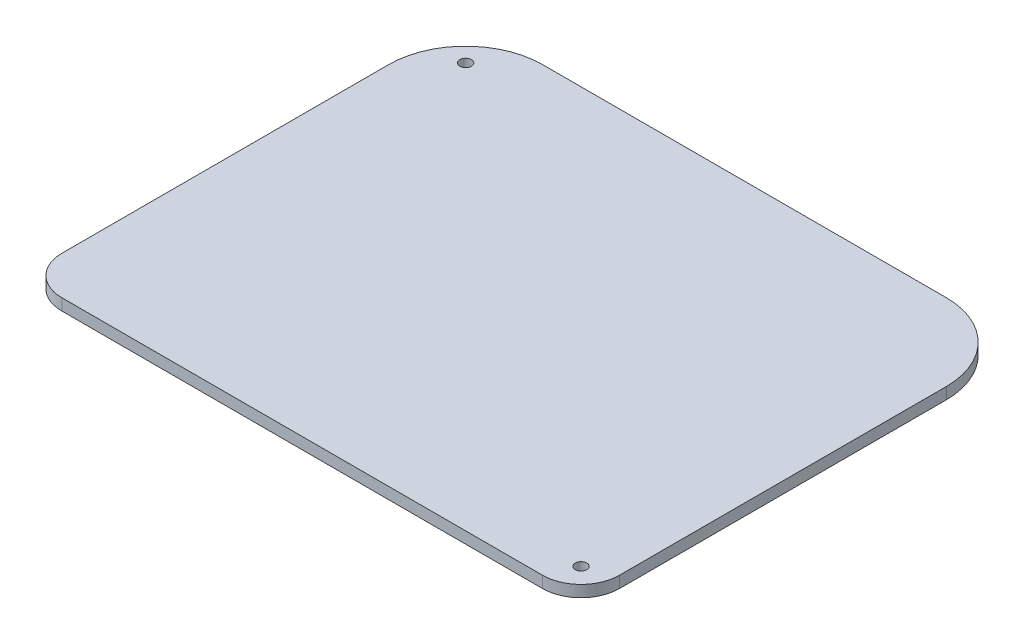
ISO-10303-21;
HEADER;
FILE_DESCRIPTION(('STEP AP214'),'2;1');
FILE_NAME('part.step','',(''),(''),'','','');
FILE_SCHEMA(('AUTOMOTIVE_DESIGN { 1 0 10303 214 1 1 1 1 }'));
ENDSEC;
DATA;
#1=APPLICATION_CONTEXT('core data for automotive mechanical design processes');
#2=APPLICATION_PROTOCOL_DEFINITION('international standard','automotive_design',2000,#1);
#3=PRODUCT_CONTEXT('',#1,'mechanical');
#4=PRODUCT('Part','Part','',(#3));
#5=PRODUCT_RELATED_PRODUCT_CATEGORY('part','',(#4));
#6=PRODUCT_DEFINITION_FORMATION('','',#4);
#7=PRODUCT_DEFINITION_CONTEXT('part definition',#1,'design');
#8=PRODUCT_DEFINITION('design','',#6,#7);
#9=PRODUCT_DEFINITION_SHAPE('','',#8);
#10=(LENGTH_UNIT() NAMED_UNIT(*) SI_UNIT(.MILLI.,.METRE.));
#11=(NAMED_UNIT(*) PLANE_ANGLE_UNIT() SI_UNIT($,.RADIAN.));
#12=(NAMED_UNIT(*) SI_UNIT($,.STERADIAN.) SOLID_ANGLE_UNIT());
#13=UNCERTAINTY_MEASURE_WITH_UNIT(LENGTH_MEASURE(1.E-05),#10,'distance_accuracy_value','');
#14=(GEOMETRIC_REPRESENTATION_CONTEXT(3) GLOBAL_UNCERTAINTY_ASSIGNED_CONTEXT((#13)) GLOBAL_UNIT_ASSIGNED_CONTEXT((#10,
#11,#12)) REPRESENTATION_CONTEXT('',''));
#15=CARTESIAN_POINT('',(0.,0.,0.));
#16=DIRECTION('',(0.,0.,1.));
#17=DIRECTION('',(1.,0.,0.));
#18=AXIS2_PLACEMENT_3D('',#15,#16,#17);
#19=CARTESIAN_POINT('',(72.5,3.,-57.5));
#20=DIRECTION('',(-1.,0.,0.));
#21=DIRECTION('',(0.,0.,1.));
#22=AXIS2_PLACEMENT_3D('',#19,#20,#21);
#23=PLANE('',#22);
#24=DIRECTION('',(0.,0.,-1.));
#25=VECTOR('',#24,1.);
#26=CARTESIAN_POINT('',(72.5,0.,-57.5));
#27=LINE('',#26,#25);
#28=CARTESIAN_POINT('',(72.5,0.,47.5));
#29=VERTEX_POINT('',#28);
#30=CARTESIAN_POINT('',(72.5,0.,-37.5));
#31=VERTEX_POINT('',#30);
#32=EDGE_CURVE('E119',#29,#31,#27,.T.);
#33=ORIENTED_EDGE('',*,*,#32,.T.);
#34=DIRECTION('',(0.,-1.,0.));
#35=VECTOR('',#34,1.);
#36=CARTESIAN_POINT('',(72.5,3.,-37.5));
#37=LINE('',#36,#35);
#38=CARTESIAN_POINT('',(72.5,3.,-37.5));
#39=VERTEX_POINT('',#38);
#40=EDGE_CURVE('E61',#31,#39,#37,.F.);
#41=ORIENTED_EDGE('',*,*,#40,.T.);
#42=DIRECTION('',(0.,0.,-1.));
#43=VECTOR('',#42,1.);
#44=CARTESIAN_POINT('',(72.5,3.,-57.5));
#45=LINE('',#44,#43);
#46=CARTESIAN_POINT('',(72.5,3.,47.5));
#47=VERTEX_POINT('',#46);
#48=EDGE_CURVE('E120',#47,#39,#45,.T.);
#49=ORIENTED_EDGE('',*,*,#48,.F.);
#50=DIRECTION('',(0.,-1.,0.));
#51=VECTOR('',#50,1.);
#52=CARTESIAN_POINT('',(72.5,3.,47.5));
#53=LINE('',#52,#51);
#54=EDGE_CURVE('E110',#47,#29,#53,.T.);
#55=ORIENTED_EDGE('',*,*,#54,.T.);
#56=EDGE_LOOP('',(#33,#41,#49,#55));
#57=FACE_BOUND('',#56,.T.);
#58=ADVANCED_FACE('F38',(#57),#23,.F.);
#59=CARTESIAN_POINT('',(-72.5,3.,-57.5));
#60=DIRECTION('',(0.,0.,1.));
#61=DIRECTION('',(1.,0.,0.));
#62=AXIS2_PLACEMENT_3D('',#59,#60,#61);
#63=PLANE('',#62);
#64=DIRECTION('',(-1.,0.,0.));
#65=VECTOR('',#64,1.);
#66=CARTESIAN_POINT('',(-72.5,3.,-57.5));
#67=LINE('',#66,#65);
#68=CARTESIAN_POINT('',(52.5,3.,-57.5));
#69=VERTEX_POINT('',#68);
#70=CARTESIAN_POINT('',(-52.5,3.,-57.5));
#71=VERTEX_POINT('',#70);
#72=EDGE_CURVE('E165',#69,#71,#67,.T.);
#73=ORIENTED_EDGE('',*,*,#72,.F.);
#74=DIRECTION('',(0.,-1.,0.));
#75=VECTOR('',#74,1.);
#76=CARTESIAN_POINT('',(52.5,3.,-57.5));
#77=LINE('',#76,#75);
#78=CARTESIAN_POINT('',(52.5,0.,-57.5));
#79=VERTEX_POINT('',#78);
#80=EDGE_CURVE('E155',#69,#79,#77,.T.);
#81=ORIENTED_EDGE('',*,*,#80,.T.);
#82=DIRECTION('',(-1.,0.,0.));
#83=VECTOR('',#82,1.);
#84=CARTESIAN_POINT('',(-72.5,0.,-57.5));
#85=LINE('',#84,#83);
#86=CARTESIAN_POINT('',(-52.5,0.,-57.5));
#87=VERTEX_POINT('',#86);
#88=EDGE_CURVE('E126',#79,#87,#85,.T.);
#89=ORIENTED_EDGE('',*,*,#88,.T.);
#90=DIRECTION('',(0.,-1.,0.));
#91=VECTOR('',#90,1.);
#92=CARTESIAN_POINT('',(-52.5,3.,-57.5));
#93=LINE('',#92,#91);
#94=EDGE_CURVE('E153',#87,#71,#93,.F.);
#95=ORIENTED_EDGE('',*,*,#94,.T.);
#96=EDGE_LOOP('',(#73,#81,#89,#95));
#97=FACE_BOUND('',#96,.T.);
#98=ADVANCED_FACE('F169',(#97),#63,.F.);
#99=CARTESIAN_POINT('',(-72.5,3.,-57.5));
#100=DIRECTION('',(1.,0.,0.));
#101=DIRECTION('',(0.,0.,-1.));
#102=AXIS2_PLACEMENT_3D('',#99,#100,#101);
#103=PLANE('',#102);
#104=DIRECTION('',(0.,0.,1.));
#105=VECTOR('',#104,1.);
#106=CARTESIAN_POINT('',(-72.5,3.,-57.5));
#107=LINE('',#106,#105);
#108=CARTESIAN_POINT('',(-72.5,3.,-37.5));
#109=VERTEX_POINT('',#108);
#110=CARTESIAN_POINT('',(-72.5,3.,47.5));
#111=VERTEX_POINT('',#110);
#112=EDGE_CURVE('E171',#109,#111,#107,.T.);
#113=ORIENTED_EDGE('',*,*,#112,.F.);
#114=DIRECTION('',(0.,-1.,0.));
#115=VECTOR('',#114,1.);
#116=CARTESIAN_POINT('',(-72.5,3.,-37.5));
#117=LINE('',#116,#115);
#118=CARTESIAN_POINT('',(-72.5,0.,-37.5));
#119=VERTEX_POINT('',#118);
#120=EDGE_CURVE('E11',#109,#119,#117,.T.);
#121=ORIENTED_EDGE('',*,*,#120,.T.);
#122=DIRECTION('',(0.,0.,1.));
#123=VECTOR('',#122,1.);
#124=CARTESIAN_POINT('',(-72.5,0.,-57.5));
#125=LINE('',#124,#123);
#126=CARTESIAN_POINT('',(-72.5,0.,47.5));
#127=VERTEX_POINT('',#126);
#128=EDGE_CURVE('E130',#119,#127,#125,.T.);
#129=ORIENTED_EDGE('',*,*,#128,.T.);
#130=DIRECTION('',(0.,-1.,0.));
#131=VECTOR('',#130,1.);
#132=CARTESIAN_POINT('',(-72.5,3.,47.5));
#133=LINE('',#132,#131);
#134=EDGE_CURVE('E150',#127,#111,#133,.F.);
#135=ORIENTED_EDGE('',*,*,#134,.T.);
#136=EDGE_LOOP('',(#113,#121,#129,#135));
#137=FACE_BOUND('',#136,.T.);
#138=ADVANCED_FACE('F189',(#137),#103,.F.);
#139=CARTESIAN_POINT('',(-72.5,3.,57.5));
#140=DIRECTION('',(0.,0.,-1.));
#141=DIRECTION('',(-1.,0.,0.));
#142=AXIS2_PLACEMENT_3D('',#139,#140,#141);
#143=PLANE('',#142);
#144=DIRECTION('',(1.,0.,0.));
#145=VECTOR('',#144,1.);
#146=CARTESIAN_POINT('',(-72.5,0.,57.5));
#147=LINE('',#146,#145);
#148=CARTESIAN_POINT('',(-62.5,0.,57.5));
#149=VERTEX_POINT('',#148);
#150=CARTESIAN_POINT('',(62.5,0.,57.5));
#151=VERTEX_POINT('',#150);
#152=EDGE_CURVE('E139',#149,#151,#147,.T.);
#153=ORIENTED_EDGE('',*,*,#152,.T.);
#154=DIRECTION('',(0.,-1.,0.));
#155=VECTOR('',#154,1.);
#156=CARTESIAN_POINT('',(62.5,3.,57.5));
#157=LINE('',#156,#155);
#158=CARTESIAN_POINT('',(62.5,3.,57.5));
#159=VERTEX_POINT('',#158);
#160=EDGE_CURVE('E111',#151,#159,#157,.F.);
#161=ORIENTED_EDGE('',*,*,#160,.T.);
#162=DIRECTION('',(1.,0.,0.));
#163=VECTOR('',#162,1.);
#164=CARTESIAN_POINT('',(-72.5,3.,57.5));
#165=LINE('',#164,#163);
#166=CARTESIAN_POINT('',(-62.5,3.,57.5));
#167=VERTEX_POINT('',#166);
#168=EDGE_CURVE('E121',#167,#159,#165,.T.);
#169=ORIENTED_EDGE('',*,*,#168,.F.);
#170=DIRECTION('',(0.,-1.,0.));
#171=VECTOR('',#170,1.);
#172=CARTESIAN_POINT('',(-62.5,3.,57.5));
#173=LINE('',#172,#171);
#174=EDGE_CURVE('E116',#167,#149,#173,.T.);
#175=ORIENTED_EDGE('',*,*,#174,.T.);
#176=EDGE_LOOP('',(#153,#161,#169,#175));
#177=FACE_BOUND('',#176,.T.);
#178=ADVANCED_FACE('F203',(#177),#143,.F.);
#179=CARTESIAN_POINT('',(0.,3.,0.));
#180=DIRECTION('',(0.,1.,0.));
#181=DIRECTION('',(0.,0.,1.));
#182=AXIS2_PLACEMENT_3D('',#179,#180,#181);
#183=PLANE('',#182);
#184=CARTESIAN_POINT('',(65.5,3.,50.5));
#185=DIRECTION('',(0.,1.,0.));
#186=DIRECTION('',(0.,0.,1.));
#187=AXIS2_PLACEMENT_3D('',#184,#185,#186);
#188=CIRCLE('',#187,1.5);
#189=CARTESIAN_POINT('',(65.5,3.,52.));
#190=VERTEX_POINT('',#189);
#191=EDGE_CURVE('E133',#190,#190,#188,.F.);
#192=ORIENTED_EDGE('',*,*,#191,.T.);
#193=EDGE_LOOP('',(#192));
#194=FACE_BOUND('',#193,.T.);
#195=CARTESIAN_POINT('',(-62.8681037641606,3.,-47.8673007714478));
#196=DIRECTION('',(0.,1.,0.));
#197=DIRECTION('',(0.,0.,1.));
#198=AXIS2_PLACEMENT_3D('',#195,#196,#197);
#199=CIRCLE('',#198,1.5);
#200=CARTESIAN_POINT('',(-62.8681037641606,3.,-46.3673007714478));
#201=VERTEX_POINT('',#200);
#202=EDGE_CURVE('E225',#201,#201,#199,.F.);
#203=ORIENTED_EDGE('',*,*,#202,.T.);
#204=EDGE_LOOP('',(#203));
#205=FACE_BOUND('',#204,.T.);
#206=ORIENTED_EDGE('',*,*,#48,.T.);
#207=CARTESIAN_POINT('',(52.5,3.,-37.5));
#208=DIRECTION('',(0.,1.,0.));
#209=DIRECTION('',(0.,0.,1.));
#210=AXIS2_PLACEMENT_3D('',#207,#208,#209);
#211=CIRCLE('',#210,20.);
#212=EDGE_CURVE('E46',#39,#69,#211,.T.);
#213=ORIENTED_EDGE('',*,*,#212,.T.);
#214=ORIENTED_EDGE('',*,*,#72,.T.);
#215=CARTESIAN_POINT('',(-52.5,3.,-37.5));
#216=DIRECTION('',(0.,1.,0.));
#217=DIRECTION('',(0.,0.,1.));
#218=AXIS2_PLACEMENT_3D('',#215,#216,#217);
#219=CIRCLE('',#218,20.);
#220=EDGE_CURVE('E53',#71,#109,#219,.T.);
#221=ORIENTED_EDGE('',*,*,#220,.T.);
#222=ORIENTED_EDGE('',*,*,#112,.T.);
#223=CARTESIAN_POINT('',(-62.5,3.,47.5));
#224=DIRECTION('',(0.,1.,0.));
#225=DIRECTION('',(0.,0.,1.));
#226=AXIS2_PLACEMENT_3D('',#223,#224,#225);
#227=CIRCLE('',#226,10.);
#228=EDGE_CURVE('E146',#111,#167,#227,.T.);
#229=ORIENTED_EDGE('',*,*,#228,.T.);
#230=ORIENTED_EDGE('',*,*,#168,.T.);
#231=CARTESIAN_POINT('',(62.5,3.,47.5));
#232=DIRECTION('',(0.,1.,0.));
#233=DIRECTION('',(0.,0.,1.));
#234=AXIS2_PLACEMENT_3D('',#231,#232,#233);
#235=CIRCLE('',#234,10.);
#236=EDGE_CURVE('E148',#159,#47,#235,.T.);
#237=ORIENTED_EDGE('',*,*,#236,.T.);
#238=EDGE_LOOP('',(#206,#213,#214,#221,#222,#229,#230,#237));
#239=FACE_BOUND('',#238,.T.);
#240=ADVANCED_FACE('F164',(#194,#205,#239),#183,.T.);
#241=CARTESIAN_POINT('',(0.,0.,0.));
#242=DIRECTION('',(0.,1.,0.));
#243=DIRECTION('',(0.,0.,1.));
#244=AXIS2_PLACEMENT_3D('',#241,#242,#243);
#245=PLANE('',#244);
#246=CARTESIAN_POINT('',(65.5,0.,50.5));
#247=DIRECTION('',(0.,-1.,0.));
#248=DIRECTION('',(0.,0.,-1.));
#249=AXIS2_PLACEMENT_3D('',#246,#247,#248);
#250=CIRCLE('',#249,1.5);
#251=CARTESIAN_POINT('',(65.5,0.,49.));
#252=VERTEX_POINT('',#251);
#253=EDGE_CURVE('E127',#252,#252,#250,.T.);
#254=ORIENTED_EDGE('',*,*,#253,.F.);
#255=EDGE_LOOP('',(#254));
#256=FACE_BOUND('',#255,.T.);
#257=CARTESIAN_POINT('',(-62.8681037641606,0.,-47.8673007714478));
#258=DIRECTION('',(0.,-1.,0.));
#259=DIRECTION('',(0.,0.,-1.));
#260=AXIS2_PLACEMENT_3D('',#257,#258,#259);
#261=CIRCLE('',#260,1.5);
#262=CARTESIAN_POINT('',(-62.8681037641606,0.,-49.3673007714478));
#263=VERTEX_POINT('',#262);
#264=EDGE_CURVE('E228',#263,#263,#261,.T.);
#265=ORIENTED_EDGE('',*,*,#264,.F.);
#266=EDGE_LOOP('',(#265));
#267=FACE_BOUND('',#266,.T.);
#268=ORIENTED_EDGE('',*,*,#88,.F.);
#269=CARTESIAN_POINT('',(52.5,0.,-37.5));
#270=DIRECTION('',(0.,1.,0.));
#271=DIRECTION('',(0.,0.,1.));
#272=AXIS2_PLACEMENT_3D('',#269,#270,#271);
#273=CIRCLE('',#272,20.);
#274=EDGE_CURVE('E125',#79,#31,#273,.F.);
#275=ORIENTED_EDGE('',*,*,#274,.T.);
#276=ORIENTED_EDGE('',*,*,#32,.F.);
#277=CARTESIAN_POINT('',(62.5,0.,47.5));
#278=DIRECTION('',(0.,1.,0.));
#279=DIRECTION('',(0.,0.,1.));
#280=AXIS2_PLACEMENT_3D('',#277,#278,#279);
#281=CIRCLE('',#280,10.);
#282=EDGE_CURVE('E106',#29,#151,#281,.F.);
#283=ORIENTED_EDGE('',*,*,#282,.T.);
#284=ORIENTED_EDGE('',*,*,#152,.F.);
#285=CARTESIAN_POINT('',(-62.5,0.,47.5));
#286=DIRECTION('',(0.,1.,0.));
#287=DIRECTION('',(0.,0.,1.));
#288=AXIS2_PLACEMENT_3D('',#285,#286,#287);
#289=CIRCLE('',#288,10.);
#290=EDGE_CURVE('E117',#149,#127,#289,.F.);
#291=ORIENTED_EDGE('',*,*,#290,.T.);
#292=ORIENTED_EDGE('',*,*,#128,.F.);
#293=CARTESIAN_POINT('',(-52.5,0.,-37.5));
#294=DIRECTION('',(0.,1.,0.));
#295=DIRECTION('',(0.,0.,1.));
#296=AXIS2_PLACEMENT_3D('',#293,#294,#295);
#297=CIRCLE('',#296,20.);
#298=EDGE_CURVE('E158',#119,#87,#297,.F.);
#299=ORIENTED_EDGE('',*,*,#298,.T.);
#300=EDGE_LOOP('',(#268,#275,#276,#283,#284,#291,#292,#299));
#301=FACE_BOUND('',#300,.T.);
#302=ADVANCED_FACE('F124',(#256,#267,#301),#245,.F.);
#303=CARTESIAN_POINT('',(62.5,3.,47.5));
#304=DIRECTION('',(0.,-1.,0.));
#305=DIRECTION('',(0.,0.,-1.));
#306=AXIS2_PLACEMENT_3D('',#303,#304,#305);
#307=CYLINDRICAL_SURFACE('',#306,10.);
#308=ORIENTED_EDGE('',*,*,#236,.F.);
#309=ORIENTED_EDGE('',*,*,#160,.F.);
#310=ORIENTED_EDGE('',*,*,#282,.F.);
#311=ORIENTED_EDGE('',*,*,#54,.F.);
#312=EDGE_LOOP('',(#308,#309,#310,#311));
#313=FACE_BOUND('',#312,.T.);
#314=ADVANCED_FACE('F109',(#313),#307,.T.);
#315=CARTESIAN_POINT('',(-62.5,3.,47.5));
#316=DIRECTION('',(0.,-1.,0.));
#317=DIRECTION('',(0.,0.,-1.));
#318=AXIS2_PLACEMENT_3D('',#315,#316,#317);
#319=CYLINDRICAL_SURFACE('',#318,10.);
#320=ORIENTED_EDGE('',*,*,#228,.F.);
#321=ORIENTED_EDGE('',*,*,#134,.F.);
#322=ORIENTED_EDGE('',*,*,#290,.F.);
#323=ORIENTED_EDGE('',*,*,#174,.F.);
#324=EDGE_LOOP('',(#320,#321,#322,#323));
#325=FACE_BOUND('',#324,.T.);
#326=ADVANCED_FACE('F175',(#325),#319,.T.);
#327=CARTESIAN_POINT('',(52.5,3.,-37.5));
#328=DIRECTION('',(0.,-1.,0.));
#329=DIRECTION('',(0.,0.,-1.));
#330=AXIS2_PLACEMENT_3D('',#327,#328,#329);
#331=CYLINDRICAL_SURFACE('',#330,20.);
#332=ORIENTED_EDGE('',*,*,#212,.F.);
#333=ORIENTED_EDGE('',*,*,#40,.F.);
#334=ORIENTED_EDGE('',*,*,#274,.F.);
#335=ORIENTED_EDGE('',*,*,#80,.F.);
#336=EDGE_LOOP('',(#332,#333,#334,#335));
#337=FACE_BOUND('',#336,.T.);
#338=ADVANCED_FACE('F173',(#337),#331,.T.);
#339=CARTESIAN_POINT('',(-52.5,3.,-37.5));
#340=DIRECTION('',(0.,-1.,0.));
#341=DIRECTION('',(0.,0.,-1.));
#342=AXIS2_PLACEMENT_3D('',#339,#340,#341);
#343=CYLINDRICAL_SURFACE('',#342,20.);
#344=ORIENTED_EDGE('',*,*,#220,.F.);
#345=ORIENTED_EDGE('',*,*,#94,.F.);
#346=ORIENTED_EDGE('',*,*,#298,.F.);
#347=ORIENTED_EDGE('',*,*,#120,.F.);
#348=EDGE_LOOP('',(#344,#345,#346,#347));
#349=FACE_BOUND('',#348,.T.);
#350=ADVANCED_FACE('F40',(#349),#343,.T.);
#351=CARTESIAN_POINT('',(-62.8681037641606,3.001,-47.8673007714478));
#352=DIRECTION('',(0.,-1.,0.));
#353=DIRECTION('',(0.,0.,-1.));
#354=AXIS2_PLACEMENT_3D('',#351,#352,#353);
#355=CYLINDRICAL_SURFACE('',#354,1.5);
#356=ORIENTED_EDGE('',*,*,#202,.F.);
#357=EDGE_LOOP('',(#356));
#358=FACE_BOUND('',#357,.T.);
#359=ORIENTED_EDGE('',*,*,#264,.T.);
#360=EDGE_LOOP('',(#359));
#361=FACE_BOUND('',#360,.T.);
#362=ADVANCED_FACE('F180',(#358,#361),#355,.F.);
#363=CARTESIAN_POINT('',(65.5,3.001,50.5));
#364=DIRECTION('',(0.,-1.,0.));
#365=DIRECTION('',(0.,0.,-1.));
#366=AXIS2_PLACEMENT_3D('',#363,#364,#365);
#367=CYLINDRICAL_SURFACE('',#366,1.5);
#368=ORIENTED_EDGE('',*,*,#191,.F.);
#369=EDGE_LOOP('',(#368));
#370=FACE_BOUND('',#369,.T.);
#371=ORIENTED_EDGE('',*,*,#253,.T.);
#372=EDGE_LOOP('',(#371));
#373=FACE_BOUND('',#372,.T.);
#374=ADVANCED_FACE('F235',(#370,#373),#367,.F.);
#375=CLOSED_SHELL('',(#58,#98,#138,#178,#240,#302,#314,#326,#338,#350,#362,#374));
#376=MANIFOLD_SOLID_BREP('B2',#375);
#377=ADVANCED_BREP_SHAPE_REPRESENTATION('',(#18,#376),#14);
#378=SHAPE_DEFINITION_REPRESENTATION(#9,#377);
ENDSEC;
END-ISO-10303-21;
